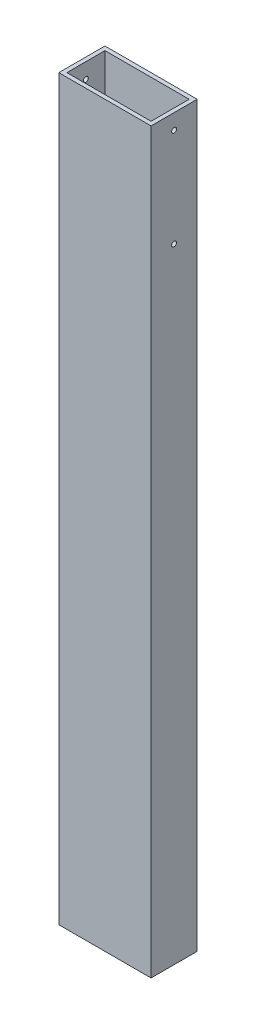
ISO-10303-21;
HEADER;
FILE_DESCRIPTION(('STEP AP214'),'2;1');
FILE_NAME('part.step','',(''),(''),'','','');
FILE_SCHEMA(('AUTOMOTIVE_DESIGN { 1 0 10303 214 1 1 1 1 }'));
ENDSEC;
DATA;
#1=APPLICATION_CONTEXT('core data for automotive mechanical design processes');
#2=APPLICATION_PROTOCOL_DEFINITION('international standard','automotive_design',2000,#1);
#3=PRODUCT_CONTEXT('',#1,'mechanical');
#4=PRODUCT('Part','Part','',(#3));
#5=PRODUCT_RELATED_PRODUCT_CATEGORY('part','',(#4));
#6=PRODUCT_DEFINITION_FORMATION('','',#4);
#7=PRODUCT_DEFINITION_CONTEXT('part definition',#1,'design');
#8=PRODUCT_DEFINITION('design','',#6,#7);
#9=PRODUCT_DEFINITION_SHAPE('','',#8);
#10=(LENGTH_UNIT() NAMED_UNIT(*) SI_UNIT(.MILLI.,.METRE.));
#11=(NAMED_UNIT(*) PLANE_ANGLE_UNIT() SI_UNIT($,.RADIAN.));
#12=(NAMED_UNIT(*) SI_UNIT($,.STERADIAN.) SOLID_ANGLE_UNIT());
#13=UNCERTAINTY_MEASURE_WITH_UNIT(LENGTH_MEASURE(1.E-05),#10,'distance_accuracy_value','');
#14=(GEOMETRIC_REPRESENTATION_CONTEXT(3) GLOBAL_UNCERTAINTY_ASSIGNED_CONTEXT((#13)) GLOBAL_UNIT_ASSIGNED_CONTEXT((#10,
#11,#12)) REPRESENTATION_CONTEXT('',''));
#15=CARTESIAN_POINT('',(0.,0.,0.));
#16=DIRECTION('',(0.,0.,1.));
#17=DIRECTION('',(1.,0.,0.));
#18=AXIS2_PLACEMENT_3D('',#15,#16,#17);
#19=CARTESIAN_POINT('',(19.05,304.8,-9.525));
#20=DIRECTION('',(0.,-1.,0.));
#21=DIRECTION('',(0.,0.,-1.));
#22=AXIS2_PLACEMENT_3D('',#19,#20,#21);
#23=PLANE('',#22);
#24=DIRECTION('',(0.,0.,-1.));
#25=VECTOR('',#24,1.);
#26=CARTESIAN_POINT('',(19.05,304.8,9.525));
#27=LINE('',#26,#25);
#28=CARTESIAN_POINT('',(19.05,304.8,9.525));
#29=VERTEX_POINT('',#28);
#30=CARTESIAN_POINT('',(19.05,304.8,-9.525));
#31=VERTEX_POINT('',#30);
#32=EDGE_CURVE('E140',#29,#31,#27,.T.);
#33=ORIENTED_EDGE('',*,*,#32,.T.);
#34=DIRECTION('',(-1.,0.,0.));
#35=VECTOR('',#34,1.);
#36=CARTESIAN_POINT('',(-19.05,304.8,-9.525));
#37=LINE('',#36,#35);
#38=CARTESIAN_POINT('',(-19.05,304.8,-9.525));
#39=VERTEX_POINT('',#38);
#40=EDGE_CURVE('E143',#31,#39,#37,.T.);
#41=ORIENTED_EDGE('',*,*,#40,.T.);
#42=DIRECTION('',(0.,0.,1.));
#43=VECTOR('',#42,1.);
#44=CARTESIAN_POINT('',(-19.05,304.8,9.525));
#45=LINE('',#44,#43);
#46=CARTESIAN_POINT('',(-19.05,304.8,9.525));
#47=VERTEX_POINT('',#46);
#48=EDGE_CURVE('E146',#39,#47,#45,.T.);
#49=ORIENTED_EDGE('',*,*,#48,.T.);
#50=DIRECTION('',(1.,0.,0.));
#51=VECTOR('',#50,1.);
#52=CARTESIAN_POINT('',(-19.05,304.8,9.525));
#53=LINE('',#52,#51);
#54=EDGE_CURVE('E148',#47,#29,#53,.T.);
#55=ORIENTED_EDGE('',*,*,#54,.T.);
#56=EDGE_LOOP('',(#33,#41,#49,#55));
#57=FACE_BOUND('',#56,.T.);
#58=DIRECTION('',(0.,0.,-1.));
#59=VECTOR('',#58,1.);
#60=CARTESIAN_POINT('',(17.399,304.8,7.874));
#61=LINE('',#60,#59);
#62=CARTESIAN_POINT('',(17.399,304.8,7.874));
#63=VERTEX_POINT('',#62);
#64=CARTESIAN_POINT('',(17.399,304.8,-7.874));
#65=VERTEX_POINT('',#64);
#66=EDGE_CURVE('E102',#63,#65,#61,.T.);
#67=ORIENTED_EDGE('',*,*,#66,.F.);
#68=DIRECTION('',(1.,0.,0.));
#69=VECTOR('',#68,1.);
#70=CARTESIAN_POINT('',(-17.399,304.8,7.874));
#71=LINE('',#70,#69);
#72=CARTESIAN_POINT('',(-17.399,304.8,7.874));
#73=VERTEX_POINT('',#72);
#74=EDGE_CURVE('E124',#73,#63,#71,.T.);
#75=ORIENTED_EDGE('',*,*,#74,.F.);
#76=DIRECTION('',(0.,0.,1.));
#77=VECTOR('',#76,1.);
#78=CARTESIAN_POINT('',(-17.399,304.8,7.874));
#79=LINE('',#78,#77);
#80=CARTESIAN_POINT('',(-17.399,304.8,-7.874));
#81=VERTEX_POINT('',#80);
#82=EDGE_CURVE('E122',#81,#73,#79,.T.);
#83=ORIENTED_EDGE('',*,*,#82,.F.);
#84=DIRECTION('',(-1.,0.,0.));
#85=VECTOR('',#84,1.);
#86=CARTESIAN_POINT('',(-17.399,304.8,-7.874));
#87=LINE('',#86,#85);
#88=EDGE_CURVE('E110',#65,#81,#87,.T.);
#89=ORIENTED_EDGE('',*,*,#88,.F.);
#90=EDGE_LOOP('',(#67,#75,#83,#89));
#91=FACE_BOUND('',#90,.T.);
#92=ADVANCED_FACE('F35',(#57,#91),#23,.F.);
#93=CARTESIAN_POINT('',(19.05,0.,-9.525));
#94=DIRECTION('',(0.,-1.,0.));
#95=DIRECTION('',(0.,0.,-1.));
#96=AXIS2_PLACEMENT_3D('',#93,#94,#95);
#97=PLANE('',#96);
#98=DIRECTION('',(0.,0.,-1.));
#99=VECTOR('',#98,1.);
#100=CARTESIAN_POINT('',(19.05,0.,9.525));
#101=LINE('',#100,#99);
#102=CARTESIAN_POINT('',(19.05,0.,9.525));
#103=VERTEX_POINT('',#102);
#104=CARTESIAN_POINT('',(19.05,0.,-9.525));
#105=VERTEX_POINT('',#104);
#106=EDGE_CURVE('E118',#103,#105,#101,.T.);
#107=ORIENTED_EDGE('',*,*,#106,.F.);
#108=DIRECTION('',(1.,0.,0.));
#109=VECTOR('',#108,1.);
#110=CARTESIAN_POINT('',(-19.05,0.,9.525));
#111=LINE('',#110,#109);
#112=CARTESIAN_POINT('',(-19.05,0.,9.525));
#113=VERTEX_POINT('',#112);
#114=EDGE_CURVE('E144',#113,#103,#111,.T.);
#115=ORIENTED_EDGE('',*,*,#114,.F.);
#116=DIRECTION('',(0.,0.,1.));
#117=VECTOR('',#116,1.);
#118=CARTESIAN_POINT('',(-19.05,0.,9.525));
#119=LINE('',#118,#117);
#120=CARTESIAN_POINT('',(-19.05,0.,-9.525));
#121=VERTEX_POINT('',#120);
#122=EDGE_CURVE('E155',#121,#113,#119,.T.);
#123=ORIENTED_EDGE('',*,*,#122,.F.);
#124=DIRECTION('',(-1.,0.,0.));
#125=VECTOR('',#124,1.);
#126=CARTESIAN_POINT('',(-19.05,0.,-9.525));
#127=LINE('',#126,#125);
#128=EDGE_CURVE('E153',#105,#121,#127,.T.);
#129=ORIENTED_EDGE('',*,*,#128,.F.);
#130=EDGE_LOOP('',(#107,#115,#123,#129));
#131=FACE_BOUND('',#130,.T.);
#132=DIRECTION('',(1.,0.,0.));
#133=VECTOR('',#132,1.);
#134=CARTESIAN_POINT('',(-17.399,0.,7.874));
#135=LINE('',#134,#133);
#136=CARTESIAN_POINT('',(-17.399,0.,7.874));
#137=VERTEX_POINT('',#136);
#138=CARTESIAN_POINT('',(17.399,0.,7.874));
#139=VERTEX_POINT('',#138);
#140=EDGE_CURVE('E111',#137,#139,#135,.T.);
#141=ORIENTED_EDGE('',*,*,#140,.T.);
#142=DIRECTION('',(0.,0.,-1.));
#143=VECTOR('',#142,1.);
#144=CARTESIAN_POINT('',(17.399,0.,7.874));
#145=LINE('',#144,#143);
#146=CARTESIAN_POINT('',(17.399,0.,-7.874));
#147=VERTEX_POINT('',#146);
#148=EDGE_CURVE('E60',#139,#147,#145,.T.);
#149=ORIENTED_EDGE('',*,*,#148,.T.);
#150=DIRECTION('',(-1.,0.,0.));
#151=VECTOR('',#150,1.);
#152=CARTESIAN_POINT('',(-17.399,0.,-7.874));
#153=LINE('',#152,#151);
#154=CARTESIAN_POINT('',(-17.399,0.,-7.874));
#155=VERTEX_POINT('',#154);
#156=EDGE_CURVE('E117',#147,#155,#153,.T.);
#157=ORIENTED_EDGE('',*,*,#156,.T.);
#158=DIRECTION('',(0.,0.,1.));
#159=VECTOR('',#158,1.);
#160=CARTESIAN_POINT('',(-17.399,0.,7.874));
#161=LINE('',#160,#159);
#162=EDGE_CURVE('E132',#155,#137,#161,.T.);
#163=ORIENTED_EDGE('',*,*,#162,.T.);
#164=EDGE_LOOP('',(#141,#149,#157,#163));
#165=FACE_BOUND('',#164,.T.);
#166=ADVANCED_FACE('F202',(#131,#165),#97,.T.);
#167=CARTESIAN_POINT('',(19.05,304.8,9.525));
#168=DIRECTION('',(-1.,0.,0.));
#169=DIRECTION('',(0.,0.,1.));
#170=AXIS2_PLACEMENT_3D('',#167,#168,#169);
#171=PLANE('',#170);
#172=CARTESIAN_POINT('',(19.05,257.81,0.));
#173=DIRECTION('',(1.,0.,0.));
#174=DIRECTION('',(0.,0.,-1.));
#175=AXIS2_PLACEMENT_3D('',#172,#173,#174);
#176=CIRCLE('',#175,1.01599999999998);
#177=CARTESIAN_POINT('',(19.05,257.81,-1.01599999999998));
#178=VERTEX_POINT('',#177);
#179=EDGE_CURVE('E181',#178,#178,#176,.T.);
#180=ORIENTED_EDGE('',*,*,#179,.F.);
#181=EDGE_LOOP('',(#180));
#182=FACE_BOUND('',#181,.T.);
#183=CARTESIAN_POINT('',(19.05,298.45,0.));
#184=DIRECTION('',(1.,0.,0.));
#185=DIRECTION('',(0.,0.,-1.));
#186=AXIS2_PLACEMENT_3D('',#183,#184,#185);
#187=CIRCLE('',#186,1.01599999999998);
#188=CARTESIAN_POINT('',(19.05,298.45,-1.01599999999998));
#189=VERTEX_POINT('',#188);
#190=EDGE_CURVE('E171',#189,#189,#187,.T.);
#191=ORIENTED_EDGE('',*,*,#190,.F.);
#192=EDGE_LOOP('',(#191));
#193=FACE_BOUND('',#192,.T.);
#194=ORIENTED_EDGE('',*,*,#106,.T.);
#195=DIRECTION('',(0.,-1.,0.));
#196=VECTOR('',#195,1.);
#197=CARTESIAN_POINT('',(19.05,304.8,-9.525));
#198=LINE('',#197,#196);
#199=EDGE_CURVE('E11',#31,#105,#198,.T.);
#200=ORIENTED_EDGE('',*,*,#199,.F.);
#201=ORIENTED_EDGE('',*,*,#32,.F.);
#202=DIRECTION('',(0.,-1.,0.));
#203=VECTOR('',#202,1.);
#204=CARTESIAN_POINT('',(19.05,304.8,9.525));
#205=LINE('',#204,#203);
#206=EDGE_CURVE('E150',#29,#103,#205,.T.);
#207=ORIENTED_EDGE('',*,*,#206,.T.);
#208=EDGE_LOOP('',(#194,#200,#201,#207));
#209=FACE_BOUND('',#208,.T.);
#210=ADVANCED_FACE('F37',(#182,#193,#209),#171,.F.);
#211=CARTESIAN_POINT('',(-19.05,304.8,-9.525));
#212=DIRECTION('',(0.,0.,1.));
#213=DIRECTION('',(1.,0.,0.));
#214=AXIS2_PLACEMENT_3D('',#211,#212,#213);
#215=PLANE('',#214);
#216=ORIENTED_EDGE('',*,*,#128,.T.);
#217=DIRECTION('',(0.,-1.,0.));
#218=VECTOR('',#217,1.);
#219=CARTESIAN_POINT('',(-19.05,304.8,-9.525));
#220=LINE('',#219,#218);
#221=EDGE_CURVE('E44',#39,#121,#220,.T.);
#222=ORIENTED_EDGE('',*,*,#221,.F.);
#223=ORIENTED_EDGE('',*,*,#40,.F.);
#224=ORIENTED_EDGE('',*,*,#199,.T.);
#225=EDGE_LOOP('',(#216,#222,#223,#224));
#226=FACE_BOUND('',#225,.T.);
#227=ADVANCED_FACE('F228',(#226),#215,.F.);
#228=CARTESIAN_POINT('',(-19.05,304.8,9.525));
#229=DIRECTION('',(1.,0.,0.));
#230=DIRECTION('',(0.,0.,-1.));
#231=AXIS2_PLACEMENT_3D('',#228,#229,#230);
#232=PLANE('',#231);
#233=CARTESIAN_POINT('',(-19.05,257.81,0.));
#234=DIRECTION('',(1.,0.,0.));
#235=DIRECTION('',(0.,0.,-1.));
#236=AXIS2_PLACEMENT_3D('',#233,#234,#235);
#237=CIRCLE('',#236,1.01599999999998);
#238=CARTESIAN_POINT('',(-19.05,257.81,-1.01599999999999));
#239=VERTEX_POINT('',#238);
#240=EDGE_CURVE('E184',#239,#239,#237,.T.);
#241=ORIENTED_EDGE('',*,*,#240,.T.);
#242=EDGE_LOOP('',(#241));
#243=FACE_BOUND('',#242,.T.);
#244=CARTESIAN_POINT('',(-19.05,298.45,0.));
#245=DIRECTION('',(1.,0.,0.));
#246=DIRECTION('',(0.,0.,-1.));
#247=AXIS2_PLACEMENT_3D('',#244,#245,#246);
#248=CIRCLE('',#247,1.01599999999998);
#249=CARTESIAN_POINT('',(-19.05,298.45,-1.01599999999998));
#250=VERTEX_POINT('',#249);
#251=EDGE_CURVE('E166',#250,#250,#248,.T.);
#252=ORIENTED_EDGE('',*,*,#251,.T.);
#253=EDGE_LOOP('',(#252));
#254=FACE_BOUND('',#253,.T.);
#255=ORIENTED_EDGE('',*,*,#122,.T.);
#256=DIRECTION('',(0.,-1.,0.));
#257=VECTOR('',#256,1.);
#258=CARTESIAN_POINT('',(-19.05,304.8,9.525));
#259=LINE('',#258,#257);
#260=EDGE_CURVE('E160',#47,#113,#259,.T.);
#261=ORIENTED_EDGE('',*,*,#260,.F.);
#262=ORIENTED_EDGE('',*,*,#48,.F.);
#263=ORIENTED_EDGE('',*,*,#221,.T.);
#264=EDGE_LOOP('',(#255,#261,#262,#263));
#265=FACE_BOUND('',#264,.T.);
#266=ADVANCED_FACE('F225',(#243,#254,#265),#232,.F.);
#267=CARTESIAN_POINT('',(-19.05,304.8,9.525));
#268=DIRECTION('',(0.,0.,-1.));
#269=DIRECTION('',(-1.,0.,0.));
#270=AXIS2_PLACEMENT_3D('',#267,#268,#269);
#271=PLANE('',#270);
#272=ORIENTED_EDGE('',*,*,#114,.T.);
#273=ORIENTED_EDGE('',*,*,#206,.F.);
#274=ORIENTED_EDGE('',*,*,#54,.F.);
#275=ORIENTED_EDGE('',*,*,#260,.T.);
#276=EDGE_LOOP('',(#272,#273,#274,#275));
#277=FACE_BOUND('',#276,.T.);
#278=ADVANCED_FACE('F222',(#277),#271,.F.);
#279=CARTESIAN_POINT('',(17.399,304.8,7.874));
#280=DIRECTION('',(-1.,0.,0.));
#281=DIRECTION('',(0.,0.,1.));
#282=AXIS2_PLACEMENT_3D('',#279,#280,#281);
#283=PLANE('',#282);
#284=CARTESIAN_POINT('',(17.399,257.81,0.));
#285=DIRECTION('',(-1.,0.,0.));
#286=DIRECTION('',(0.,0.,1.));
#287=AXIS2_PLACEMENT_3D('',#284,#285,#286);
#288=CIRCLE('',#287,1.01599999999998);
#289=CARTESIAN_POINT('',(17.399,257.81,1.01599999999999));
#290=VERTEX_POINT('',#289);
#291=EDGE_CURVE('E176',#290,#290,#288,.T.);
#292=ORIENTED_EDGE('',*,*,#291,.F.);
#293=EDGE_LOOP('',(#292));
#294=FACE_BOUND('',#293,.T.);
#295=CARTESIAN_POINT('',(17.399,298.45,0.));
#296=DIRECTION('',(-1.,0.,0.));
#297=DIRECTION('',(0.,0.,1.));
#298=AXIS2_PLACEMENT_3D('',#295,#296,#297);
#299=CIRCLE('',#298,1.01599999999998);
#300=CARTESIAN_POINT('',(17.399,298.45,1.01599999999998));
#301=VERTEX_POINT('',#300);
#302=EDGE_CURVE('E130',#301,#301,#299,.T.);
#303=ORIENTED_EDGE('',*,*,#302,.F.);
#304=EDGE_LOOP('',(#303));
#305=FACE_BOUND('',#304,.T.);
#306=ORIENTED_EDGE('',*,*,#148,.F.);
#307=DIRECTION('',(0.,-1.,0.));
#308=VECTOR('',#307,1.);
#309=CARTESIAN_POINT('',(17.399,304.8,7.874));
#310=LINE('',#309,#308);
#311=EDGE_CURVE('E106',#63,#139,#310,.T.);
#312=ORIENTED_EDGE('',*,*,#311,.F.);
#313=ORIENTED_EDGE('',*,*,#66,.T.);
#314=DIRECTION('',(0.,-1.,0.));
#315=VECTOR('',#314,1.);
#316=CARTESIAN_POINT('',(17.399,304.8,-7.874));
#317=LINE('',#316,#315);
#318=EDGE_CURVE('E105',#65,#147,#317,.T.);
#319=ORIENTED_EDGE('',*,*,#318,.T.);
#320=EDGE_LOOP('',(#306,#312,#313,#319));
#321=FACE_BOUND('',#320,.T.);
#322=ADVANCED_FACE('F104',(#294,#305,#321),#283,.T.);
#323=CARTESIAN_POINT('',(-17.399,304.8,-7.874));
#324=DIRECTION('',(0.,0.,1.));
#325=DIRECTION('',(1.,0.,0.));
#326=AXIS2_PLACEMENT_3D('',#323,#324,#325);
#327=PLANE('',#326);
#328=ORIENTED_EDGE('',*,*,#156,.F.);
#329=ORIENTED_EDGE('',*,*,#318,.F.);
#330=ORIENTED_EDGE('',*,*,#88,.T.);
#331=DIRECTION('',(0.,-1.,0.));
#332=VECTOR('',#331,1.);
#333=CARTESIAN_POINT('',(-17.399,304.8,-7.874));
#334=LINE('',#333,#332);
#335=EDGE_CURVE('E119',#81,#155,#334,.T.);
#336=ORIENTED_EDGE('',*,*,#335,.T.);
#337=EDGE_LOOP('',(#328,#329,#330,#336));
#338=FACE_BOUND('',#337,.T.);
#339=ADVANCED_FACE('F114',(#338),#327,.T.);
#340=CARTESIAN_POINT('',(-17.399,304.8,7.874));
#341=DIRECTION('',(1.,0.,0.));
#342=DIRECTION('',(0.,0.,-1.));
#343=AXIS2_PLACEMENT_3D('',#340,#341,#342);
#344=PLANE('',#343);
#345=CARTESIAN_POINT('',(-17.399,257.81,0.));
#346=DIRECTION('',(1.,0.,0.));
#347=DIRECTION('',(0.,0.,-1.));
#348=AXIS2_PLACEMENT_3D('',#345,#346,#347);
#349=CIRCLE('',#348,1.01599999999998);
#350=CARTESIAN_POINT('',(-17.399,257.81,-1.01599999999999));
#351=VERTEX_POINT('',#350);
#352=EDGE_CURVE('E39',#351,#351,#349,.T.);
#353=ORIENTED_EDGE('',*,*,#352,.F.);
#354=EDGE_LOOP('',(#353));
#355=FACE_BOUND('',#354,.T.);
#356=CARTESIAN_POINT('',(-17.399,298.45,0.));
#357=DIRECTION('',(1.,0.,0.));
#358=DIRECTION('',(0.,0.,-1.));
#359=AXIS2_PLACEMENT_3D('',#356,#357,#358);
#360=CIRCLE('',#359,1.01599999999998);
#361=CARTESIAN_POINT('',(-17.399,298.45,-1.01599999999998));
#362=VERTEX_POINT('',#361);
#363=EDGE_CURVE('E164',#362,#362,#360,.T.);
#364=ORIENTED_EDGE('',*,*,#363,.F.);
#365=EDGE_LOOP('',(#364));
#366=FACE_BOUND('',#365,.T.);
#367=ORIENTED_EDGE('',*,*,#162,.F.);
#368=ORIENTED_EDGE('',*,*,#335,.F.);
#369=ORIENTED_EDGE('',*,*,#82,.T.);
#370=DIRECTION('',(0.,-1.,0.));
#371=VECTOR('',#370,1.);
#372=CARTESIAN_POINT('',(-17.399,304.8,7.874));
#373=LINE('',#372,#371);
#374=EDGE_CURVE('E52',#73,#137,#373,.T.);
#375=ORIENTED_EDGE('',*,*,#374,.T.);
#376=EDGE_LOOP('',(#367,#368,#369,#375));
#377=FACE_BOUND('',#376,.T.);
#378=ADVANCED_FACE('F194',(#355,#366,#377),#344,.T.);
#379=CARTESIAN_POINT('',(-17.399,304.8,7.874));
#380=DIRECTION('',(0.,0.,-1.));
#381=DIRECTION('',(-1.,0.,0.));
#382=AXIS2_PLACEMENT_3D('',#379,#380,#381);
#383=PLANE('',#382);
#384=ORIENTED_EDGE('',*,*,#140,.F.);
#385=ORIENTED_EDGE('',*,*,#374,.F.);
#386=ORIENTED_EDGE('',*,*,#74,.T.);
#387=ORIENTED_EDGE('',*,*,#311,.T.);
#388=EDGE_LOOP('',(#384,#385,#386,#387));
#389=FACE_BOUND('',#388,.T.);
#390=ADVANCED_FACE('F197',(#389),#383,.T.);
#391=CARTESIAN_POINT('',(-19.05,298.45,0.));
#392=DIRECTION('',(1.,0.,0.));
#393=DIRECTION('',(0.,0.,-1.));
#394=AXIS2_PLACEMENT_3D('',#391,#392,#393);
#395=CYLINDRICAL_SURFACE('',#394,1.01599999999998);
#396=ORIENTED_EDGE('',*,*,#363,.T.);
#397=EDGE_LOOP('',(#396));
#398=FACE_BOUND('',#397,.T.);
#399=ORIENTED_EDGE('',*,*,#251,.F.);
#400=EDGE_LOOP('',(#399));
#401=FACE_BOUND('',#400,.T.);
#402=ADVANCED_FACE('F204',(#398,#401),#395,.F.);
#403=ORIENTED_EDGE('',*,*,#302,.T.);
#404=EDGE_LOOP('',(#403));
#405=FACE_BOUND('',#404,.T.);
#406=ORIENTED_EDGE('',*,*,#190,.T.);
#407=EDGE_LOOP('',(#406));
#408=FACE_BOUND('',#407,.T.);
#409=ADVANCED_FACE('F209',(#405,#408),#395,.F.);
#410=CARTESIAN_POINT('',(-19.05,257.81,0.));
#411=DIRECTION('',(1.,0.,0.));
#412=DIRECTION('',(0.,0.,-1.));
#413=AXIS2_PLACEMENT_3D('',#410,#411,#412);
#414=CYLINDRICAL_SURFACE('',#413,1.01599999999998);
#415=ORIENTED_EDGE('',*,*,#352,.T.);
#416=EDGE_LOOP('',(#415));
#417=FACE_BOUND('',#416,.T.);
#418=ORIENTED_EDGE('',*,*,#240,.F.);
#419=EDGE_LOOP('',(#418));
#420=FACE_BOUND('',#419,.T.);
#421=ADVANCED_FACE('F191',(#417,#420),#414,.F.);
#422=ORIENTED_EDGE('',*,*,#291,.T.);
#423=EDGE_LOOP('',(#422));
#424=FACE_BOUND('',#423,.T.);
#425=ORIENTED_EDGE('',*,*,#179,.T.);
#426=EDGE_LOOP('',(#425));
#427=FACE_BOUND('',#426,.T.);
#428=ADVANCED_FACE('F258',(#424,#427),#414,.F.);
#429=CLOSED_SHELL('',(#92,#166,#210,#227,#266,#278,#322,#339,#378,#390,#402,#409,#421,#428));
#430=MANIFOLD_SOLID_BREP('B2',#429);
#431=ADVANCED_BREP_SHAPE_REPRESENTATION('',(#18,#430),#14);
#432=SHAPE_DEFINITION_REPRESENTATION(#9,#431);
ENDSEC;
END-ISO-10303-21;
